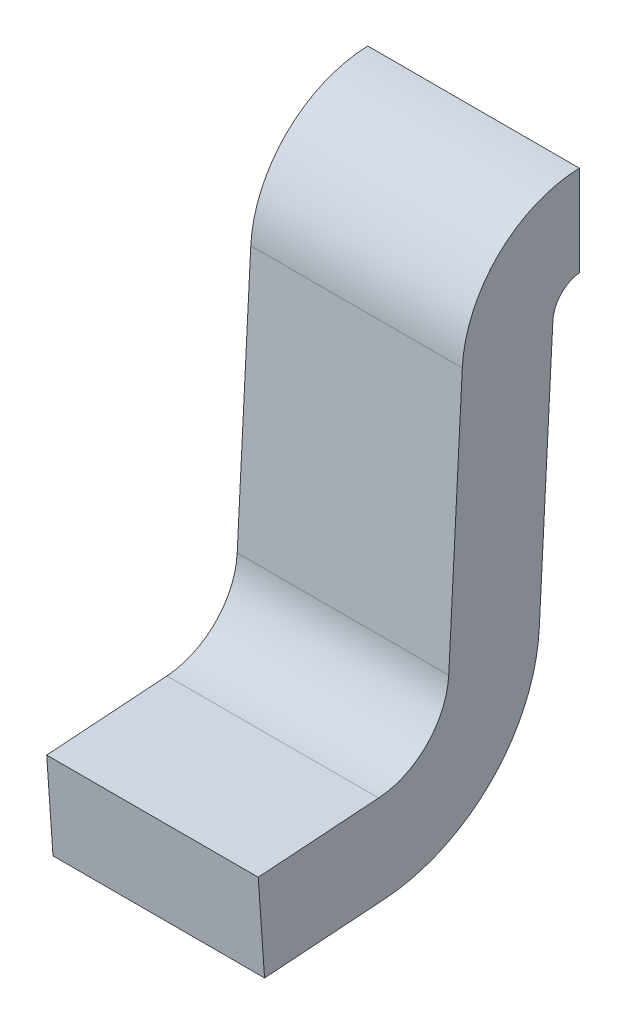
ISO-10303-21;
HEADER;
FILE_DESCRIPTION(('STEP AP214'),'2;1');
FILE_NAME('part.step','',(''),(''),'','','');
FILE_SCHEMA(('AUTOMOTIVE_DESIGN { 1 0 10303 214 1 1 1 1 }'));
ENDSEC;
DATA;
#1=APPLICATION_CONTEXT('core data for automotive mechanical design processes');
#2=APPLICATION_PROTOCOL_DEFINITION('international standard','automotive_design',2000,#1);
#3=PRODUCT_CONTEXT('',#1,'mechanical');
#4=PRODUCT('Part','Part','',(#3));
#5=PRODUCT_RELATED_PRODUCT_CATEGORY('part','',(#4));
#6=PRODUCT_DEFINITION_FORMATION('','',#4);
#7=PRODUCT_DEFINITION_CONTEXT('part definition',#1,'design');
#8=PRODUCT_DEFINITION('design','',#6,#7);
#9=PRODUCT_DEFINITION_SHAPE('','',#8);
#10=(LENGTH_UNIT() NAMED_UNIT(*) SI_UNIT(.MILLI.,.METRE.));
#11=(NAMED_UNIT(*) PLANE_ANGLE_UNIT() SI_UNIT($,.RADIAN.));
#12=(NAMED_UNIT(*) SI_UNIT($,.STERADIAN.) SOLID_ANGLE_UNIT());
#13=UNCERTAINTY_MEASURE_WITH_UNIT(LENGTH_MEASURE(1.E-05),#10,'distance_accuracy_value','');
#14=(GEOMETRIC_REPRESENTATION_CONTEXT(3) GLOBAL_UNCERTAINTY_ASSIGNED_CONTEXT((#13)) GLOBAL_UNIT_ASSIGNED_CONTEXT((#10,
#11,#12)) REPRESENTATION_CONTEXT('',''));
#15=CARTESIAN_POINT('',(0.,0.,0.));
#16=DIRECTION('',(0.,0.,1.));
#17=DIRECTION('',(1.,0.,0.));
#18=AXIS2_PLACEMENT_3D('',#15,#16,#17);
#19=CARTESIAN_POINT('',(0.14,0.,0.));
#20=DIRECTION('',(1.,0.,0.));
#21=DIRECTION('',(0.,1.,0.));
#22=AXIS2_PLACEMENT_3D('',#19,#20,#21);
#23=PLANE('',#22);
#24=CARTESIAN_POINT('',(0.14,0.08060123929937,0.21607778416));
#25=DIRECTION('',(1.,0.,0.));
#26=DIRECTION('',(0.,-0.997564050259825,-0.0697564737441177));
#27=AXIS2_PLACEMENT_3D('',#24,#25,#26);
#28=CIRCLE('',#27,0.1);
#29=CARTESIAN_POINT('',(0.14,-0.01915516572662,0.209102136786));
#30=VERTEX_POINT('',#29);
#31=CARTESIAN_POINT('',(0.14,0.07536764367507,0.116214830685));
#32=VERTEX_POINT('',#31);
#33=EDGE_CURVE('E11',#30,#32,#28,.T.);
#34=ORIENTED_EDGE('',*,*,#33,.F.);
#35=DIRECTION('',(0.,-0.0697564737441177,0.997564050259825));
#36=VECTOR('',#35,1.);
#37=CARTESIAN_POINT('',(0.14,-0.01915516572662,0.209102136786));
#38=LINE('',#37,#36);
#39=CARTESIAN_POINT('',(0.14,-0.03029231396882,0.368370776849));
#40=VERTEX_POINT('',#39);
#41=EDGE_CURVE('E42',#30,#40,#38,.T.);
#42=ORIENTED_EDGE('',*,*,#41,.T.);
#43=DIRECTION('',(0.,-0.997564050259825,-0.0697564737441177));
#44=VECTOR('',#43,1.);
#45=CARTESIAN_POINT('',(0.14,-0.03029231396882,0.368370776849));
#46=LINE('',#45,#44);
#47=CARTESIAN_POINT('',(0.14,-0.15,0.36));
#48=VERTEX_POINT('',#47);
#49=EDGE_CURVE('E203',#40,#48,#46,.T.);
#50=ORIENTED_EDGE('',*,*,#49,.T.);
#51=DIRECTION('',(0.,0.0697564737441177,-0.997564050259825));
#52=VECTOR('',#51,1.);
#53=CARTESIAN_POINT('',(0.14,-0.15,0.36));
#54=LINE('',#53,#52);
#55=CARTESIAN_POINT('',(0.14,-0.138862851758,0.200731359937));
#56=VERTEX_POINT('',#55);
#57=EDGE_CURVE('E129',#48,#56,#54,.T.);
#58=ORIENTED_EDGE('',*,*,#57,.T.);
#59=CARTESIAN_POINT('',(0.14,0.08060123929937,0.21607778416));
#60=DIRECTION('',(-1.,0.,0.));
#61=DIRECTION('',(0.,-0.0523359562429177,-0.998629534754575));
#62=AXIS2_PLACEMENT_3D('',#59,#60,#61);
#63=CIRCLE('',#62,0.22);
#64=CARTESIAN_POINT('',(0.14,0.06908732892592,-0.003620713485604));
#65=VERTEX_POINT('',#64);
#66=EDGE_CURVE('E125',#65,#56,#63,.T.);
#67=ORIENTED_EDGE('',*,*,#66,.F.);
#68=DIRECTION('',(0.,0.998629534754575,-0.0523359562429177));
#69=VECTOR('',#68,1.);
#70=CARTESIAN_POINT('',(0.14,0.06908732892592,-0.003620713485604));
#71=LINE('',#70,#69);
#72=CARTESIAN_POINT('',(0.14,0.412398267518,-0.02161287738079));
#73=VERTEX_POINT('',#72);
#74=EDGE_CURVE('E191',#65,#73,#71,.T.);
#75=ORIENTED_EDGE('',*,*,#74,.T.);
#76=CARTESIAN_POINT('',(0.14,0.410304829268,-0.06155805877097));
#77=DIRECTION('',(-1.,0.,0.));
#78=DIRECTION('',(0.,0.0523359562429277,0.998629534754575));
#79=AXIS2_PLACEMENT_3D('',#76,#77,#78);
#80=CIRCLE('',#79,0.04);
#81=CARTESIAN_POINT('',(0.14,0.45,-0.0566292231507));
#82=VERTEX_POINT('',#81);
#83=EDGE_CURVE('E187',#73,#82,#80,.T.);
#84=ORIENTED_EDGE('',*,*,#83,.T.);
#85=DIRECTION('',(0.,1.,0.));
#86=VECTOR('',#85,1.);
#87=CARTESIAN_POINT('',(0.14,0.45,-0.0566292231507));
#88=LINE('',#87,#86);
#89=CARTESIAN_POINT('',(0.14,0.57,-0.0566292231507));
#90=VERTEX_POINT('',#89);
#91=EDGE_CURVE('E177',#82,#90,#88,.T.);
#92=ORIENTED_EDGE('',*,*,#91,.T.);
#93=CARTESIAN_POINT('',(0.14,0.410075565103,-0.06154604354519));
#94=DIRECTION('',(1.,0.,0.));
#95=DIRECTION('',(0.,0.999527718107884,0.0307301274655264));
#96=AXIS2_PLACEMENT_3D('',#93,#94,#95);
#97=CIRCLE('',#96,0.16);
#98=CARTESIAN_POINT('',(0.14,0.418449318102,0.09823468201554));
#99=VERTEX_POINT('',#98);
#100=EDGE_CURVE('E157',#90,#99,#97,.T.);
#101=ORIENTED_EDGE('',*,*,#100,.T.);
#102=DIRECTION('',(0.,-0.998629534754575,0.0523359562429177));
#103=VECTOR('',#102,1.);
#104=CARTESIAN_POINT('',(0.14,0.418449318102,0.09823468201554));
#105=LINE('',#104,#103);
#106=EDGE_CURVE('E168',#99,#32,#105,.T.);
#107=ORIENTED_EDGE('',*,*,#106,.T.);
#108=EDGE_LOOP('',(#34,#42,#50,#58,#67,#75,#84,#92,#101,#107));
#109=FACE_BOUND('',#108,.T.);
#110=ADVANCED_FACE('F17',(#109),#23,.T.);
#111=CARTESIAN_POINT('',(-0.14,0.08060123929937,0.21607778416));
#112=DIRECTION('',(1.,0.,0.));
#113=DIRECTION('',(0.,-0.997564050259825,-0.0697564737441177));
#114=AXIS2_PLACEMENT_3D('',#111,#112,#113);
#115=CYLINDRICAL_SURFACE('',#114,0.1);
#116=ORIENTED_EDGE('',*,*,#33,.T.);
#117=DIRECTION('',(1.,0.,0.));
#118=VECTOR('',#117,1.);
#119=CARTESIAN_POINT('',(-0.14,0.07536764367507,0.116214830685));
#120=LINE('',#119,#118);
#121=CARTESIAN_POINT('',(-0.14,0.07536764367507,0.116214830685));
#122=VERTEX_POINT('',#121);
#123=EDGE_CURVE('E167',#122,#32,#120,.T.);
#124=ORIENTED_EDGE('',*,*,#123,.F.);
#125=CARTESIAN_POINT('',(-0.14,0.08060123929937,0.21607778416));
#126=DIRECTION('',(1.,0.,0.));
#127=DIRECTION('',(0.,-0.997564050259825,-0.0697564737441177));
#128=AXIS2_PLACEMENT_3D('',#125,#126,#127);
#129=CIRCLE('',#128,0.1);
#130=CARTESIAN_POINT('',(-0.14,-0.01915516572662,0.209102136786));
#131=VERTEX_POINT('',#130);
#132=EDGE_CURVE('E158',#131,#122,#129,.T.);
#133=ORIENTED_EDGE('',*,*,#132,.F.);
#134=DIRECTION('',(1.,0.,0.));
#135=VECTOR('',#134,1.);
#136=CARTESIAN_POINT('',(-0.14,-0.01915516572662,0.209102136786));
#137=LINE('',#136,#135);
#138=EDGE_CURVE('E25',#131,#30,#137,.T.);
#139=ORIENTED_EDGE('',*,*,#138,.T.);
#140=EDGE_LOOP('',(#116,#124,#133,#139));
#141=FACE_BOUND('',#140,.T.);
#142=ADVANCED_FACE('F215',(#141),#115,.F.);
#143=CARTESIAN_POINT('',(-0.14,-0.01298363425784,0.120845124958));
#144=DIRECTION('',(0.,0.997564050259825,0.0697564737441177));
#145=DIRECTION('',(1.,0.,0.));
#146=AXIS2_PLACEMENT_3D('',#143,#144,#145);
#147=PLANE('',#146);
#148=DIRECTION('',(1.,0.,0.));
#149=VECTOR('',#148,1.);
#150=CARTESIAN_POINT('',(-0.14,-0.03029231396882,0.368370776849));
#151=LINE('',#150,#149);
#152=CARTESIAN_POINT('',(-0.14,-0.03029231396882,0.368370776849));
#153=VERTEX_POINT('',#152);
#154=EDGE_CURVE('E206',#153,#40,#151,.T.);
#155=ORIENTED_EDGE('',*,*,#154,.T.);
#156=ORIENTED_EDGE('',*,*,#41,.F.);
#157=ORIENTED_EDGE('',*,*,#138,.F.);
#158=DIRECTION('',(0.,-0.0697564737441177,0.997564050259825));
#159=VECTOR('',#158,1.);
#160=CARTESIAN_POINT('',(-0.14,-0.01915516572662,0.209102136786));
#161=LINE('',#160,#159);
#162=EDGE_CURVE('E163',#131,#153,#161,.T.);
#163=ORIENTED_EDGE('',*,*,#162,.T.);
#164=EDGE_LOOP('',(#155,#156,#157,#163));
#165=FACE_BOUND('',#164,.T.);
#166=ADVANCED_FACE('F219',(#165),#147,.T.);
#167=CARTESIAN_POINT('',(-0.14,-0.03029231396882,0.368370776849));
#168=DIRECTION('',(0.,-0.0697564737441177,0.997564050259825));
#169=DIRECTION('',(-1.,0.,0.));
#170=AXIS2_PLACEMENT_3D('',#167,#168,#169);
#171=PLANE('',#170);
#172=DIRECTION('',(1.,0.,0.));
#173=VECTOR('',#172,1.);
#174=CARTESIAN_POINT('',(-0.14,-0.15,0.36));
#175=LINE('',#174,#173);
#176=CARTESIAN_POINT('',(-0.14,-0.15,0.36));
#177=VERTEX_POINT('',#176);
#178=EDGE_CURVE('E135',#177,#48,#175,.T.);
#179=ORIENTED_EDGE('',*,*,#178,.T.);
#180=ORIENTED_EDGE('',*,*,#49,.F.);
#181=ORIENTED_EDGE('',*,*,#154,.F.);
#182=DIRECTION('',(0.,-0.997564050259825,-0.0697564737441177));
#183=VECTOR('',#182,1.);
#184=CARTESIAN_POINT('',(-0.14,-0.03029231396882,0.368370776849));
#185=LINE('',#184,#183);
#186=EDGE_CURVE('E140',#153,#177,#185,.T.);
#187=ORIENTED_EDGE('',*,*,#186,.T.);
#188=EDGE_LOOP('',(#179,#180,#181,#187));
#189=FACE_BOUND('',#188,.T.);
#190=ADVANCED_FACE('F222',(#189),#171,.T.);
#191=CARTESIAN_POINT('',(-0.14,-0.15,0.36));
#192=DIRECTION('',(0.,-0.997564050259825,-0.0697564737441177));
#193=DIRECTION('',(0.,0.0697564737441177,-0.997564050259825));
#194=AXIS2_PLACEMENT_3D('',#191,#192,#193);
#195=PLANE('',#194);
#196=DIRECTION('',(1.,0.,0.));
#197=VECTOR('',#196,1.);
#198=CARTESIAN_POINT('',(-0.14,-0.138862851758,0.200731359937));
#199=LINE('',#198,#197);
#200=CARTESIAN_POINT('',(-0.14,-0.138862851758,0.200731359937));
#201=VERTEX_POINT('',#200);
#202=EDGE_CURVE('E118',#201,#56,#199,.T.);
#203=ORIENTED_EDGE('',*,*,#202,.T.);
#204=ORIENTED_EDGE('',*,*,#57,.F.);
#205=ORIENTED_EDGE('',*,*,#178,.F.);
#206=DIRECTION('',(0.,0.0697564737441177,-0.997564050259825));
#207=VECTOR('',#206,1.);
#208=CARTESIAN_POINT('',(-0.14,-0.15,0.36));
#209=LINE('',#208,#207);
#210=EDGE_CURVE('E132',#177,#201,#209,.T.);
#211=ORIENTED_EDGE('',*,*,#210,.T.);
#212=EDGE_LOOP('',(#203,#204,#205,#211));
#213=FACE_BOUND('',#212,.T.);
#214=ADVANCED_FACE('F133',(#213),#195,.T.);
#215=CARTESIAN_POINT('',(-0.14,0.08060123929937,0.21607778416));
#216=DIRECTION('',(-1.,0.,0.));
#217=DIRECTION('',(0.,-0.0523359562429177,-0.998629534754575));
#218=AXIS2_PLACEMENT_3D('',#215,#216,#217);
#219=CYLINDRICAL_SURFACE('',#218,0.22);
#220=ORIENTED_EDGE('',*,*,#66,.T.);
#221=ORIENTED_EDGE('',*,*,#202,.F.);
#222=CARTESIAN_POINT('',(-0.14,0.08060123929937,0.21607778416));
#223=DIRECTION('',(-1.,0.,0.));
#224=DIRECTION('',(0.,-0.0523359562429177,-0.998629534754575));
#225=AXIS2_PLACEMENT_3D('',#222,#223,#224);
#226=CIRCLE('',#225,0.22);
#227=CARTESIAN_POINT('',(-0.14,0.06908732892592,-0.003620713485604));
#228=VERTEX_POINT('',#227);
#229=EDGE_CURVE('E123',#228,#201,#226,.T.);
#230=ORIENTED_EDGE('',*,*,#229,.F.);
#231=DIRECTION('',(1.,0.,0.));
#232=VECTOR('',#231,1.);
#233=CARTESIAN_POINT('',(-0.14,0.06908732892592,-0.003620713485604));
#234=LINE('',#233,#232);
#235=EDGE_CURVE('E194',#228,#65,#234,.T.);
#236=ORIENTED_EDGE('',*,*,#235,.T.);
#237=EDGE_LOOP('',(#220,#221,#230,#236));
#238=FACE_BOUND('',#237,.T.);
#239=ADVANCED_FACE('F120',(#238),#219,.T.);
#240=CARTESIAN_POINT('',(-0.14,-0.125285482527,0.006565933915618));
#241=DIRECTION('',(0.,-0.0523359562429177,-0.998629534754575));
#242=DIRECTION('',(0.,-0.998629534754575,0.0523359562429177));
#243=AXIS2_PLACEMENT_3D('',#240,#241,#242);
#244=PLANE('',#243);
#245=DIRECTION('',(1.,0.,0.));
#246=VECTOR('',#245,1.);
#247=CARTESIAN_POINT('',(-0.14,0.412398267518,-0.02161287738079));
#248=LINE('',#247,#246);
#249=CARTESIAN_POINT('',(-0.14,0.412398267518,-0.02161287738079));
#250=VERTEX_POINT('',#249);
#251=EDGE_CURVE('E190',#250,#73,#248,.T.);
#252=ORIENTED_EDGE('',*,*,#251,.T.);
#253=ORIENTED_EDGE('',*,*,#74,.F.);
#254=ORIENTED_EDGE('',*,*,#235,.F.);
#255=DIRECTION('',(0.,-0.998629534754575,0.0523359562429177));
#256=VECTOR('',#255,1.);
#257=CARTESIAN_POINT('',(-0.14,0.412398267518,-0.02161287738079));
#258=LINE('',#257,#256);
#259=EDGE_CURVE('E146',#250,#228,#258,.T.);
#260=ORIENTED_EDGE('',*,*,#259,.F.);
#261=EDGE_LOOP('',(#252,#253,#254,#260));
#262=FACE_BOUND('',#261,.T.);
#263=ADVANCED_FACE('F226',(#262),#244,.T.);
#264=CARTESIAN_POINT('',(-0.508824635799,0.410304829268,-0.06155805877097));
#265=DIRECTION('',(1.,0.,0.));
#266=DIRECTION('',(0.,0.992379268295483,0.123220890506936));
#267=AXIS2_PLACEMENT_3D('',#264,#265,#266);
#268=CYLINDRICAL_SURFACE('',#267,0.04);
#269=ORIENTED_EDGE('',*,*,#83,.F.);
#270=ORIENTED_EDGE('',*,*,#251,.F.);
#271=CARTESIAN_POINT('',(-0.14,0.410304829268,-0.06155805877097));
#272=DIRECTION('',(1.,0.,0.));
#273=DIRECTION('',(0.,0.992379268295483,0.123220890506936));
#274=AXIS2_PLACEMENT_3D('',#271,#272,#273);
#275=CIRCLE('',#274,0.04);
#276=CARTESIAN_POINT('',(-0.14,0.45,-0.0566292231507));
#277=VERTEX_POINT('',#276);
#278=EDGE_CURVE('E153',#277,#250,#275,.T.);
#279=ORIENTED_EDGE('',*,*,#278,.F.);
#280=DIRECTION('',(1.,0.,0.));
#281=VECTOR('',#280,1.);
#282=CARTESIAN_POINT('',(-0.14,0.45,-0.0566292231507));
#283=LINE('',#282,#281);
#284=EDGE_CURVE('E180',#277,#82,#283,.T.);
#285=ORIENTED_EDGE('',*,*,#284,.T.);
#286=EDGE_LOOP('',(#269,#270,#279,#285));
#287=FACE_BOUND('',#286,.T.);
#288=ADVANCED_FACE('F232',(#287),#268,.F.);
#289=CARTESIAN_POINT('',(-0.14,0.45,-0.0566292231507));
#290=DIRECTION('',(0.,0.,-1.));
#291=DIRECTION('',(0.,-1.,0.));
#292=AXIS2_PLACEMENT_3D('',#289,#290,#291);
#293=PLANE('',#292);
#294=ORIENTED_EDGE('',*,*,#91,.F.);
#295=ORIENTED_EDGE('',*,*,#284,.F.);
#296=DIRECTION('',(0.,1.,0.));
#297=VECTOR('',#296,1.);
#298=CARTESIAN_POINT('',(-0.14,0.45,-0.0566292231507));
#299=LINE('',#298,#297);
#300=CARTESIAN_POINT('',(-0.14,0.57,-0.0566292231507));
#301=VERTEX_POINT('',#300);
#302=EDGE_CURVE('E241',#277,#301,#299,.T.);
#303=ORIENTED_EDGE('',*,*,#302,.T.);
#304=DIRECTION('',(-1.,0.,0.));
#305=VECTOR('',#304,1.);
#306=CARTESIAN_POINT('',(0.14,0.57,-0.0566292231507));
#307=LINE('',#306,#305);
#308=EDGE_CURVE('E181',#90,#301,#307,.T.);
#309=ORIENTED_EDGE('',*,*,#308,.F.);
#310=EDGE_LOOP('',(#294,#295,#303,#309));
#311=FACE_BOUND('',#310,.T.);
#312=ADVANCED_FACE('F239',(#311),#293,.T.);
#313=CARTESIAN_POINT('',(0.508824635799,0.410075565103,-0.06154604354519));
#314=DIRECTION('',(-1.,0.,0.));
#315=DIRECTION('',(0.,0.0523359562429177,0.998629534754575));
#316=AXIS2_PLACEMENT_3D('',#313,#314,#315);
#317=CYLINDRICAL_SURFACE('',#316,0.16);
#318=DIRECTION('',(-1.,0.,0.));
#319=VECTOR('',#318,1.);
#320=CARTESIAN_POINT('',(0.14,0.418449318102,0.09823468201554));
#321=LINE('',#320,#319);
#322=CARTESIAN_POINT('',(-0.14,0.418449318102,0.09823468201554));
#323=VERTEX_POINT('',#322);
#324=EDGE_CURVE('E171',#99,#323,#321,.T.);
#325=ORIENTED_EDGE('',*,*,#324,.F.);
#326=ORIENTED_EDGE('',*,*,#100,.F.);
#327=ORIENTED_EDGE('',*,*,#308,.T.);
#328=CARTESIAN_POINT('',(-0.14,0.410075565103,-0.06154604354519));
#329=DIRECTION('',(-1.,0.,0.));
#330=DIRECTION('',(0.,0.0523359562429177,0.998629534754575));
#331=AXIS2_PLACEMENT_3D('',#328,#329,#330);
#332=CIRCLE('',#331,0.16);
#333=EDGE_CURVE('E296',#323,#301,#332,.T.);
#334=ORIENTED_EDGE('',*,*,#333,.F.);
#335=EDGE_LOOP('',(#325,#326,#327,#334));
#336=FACE_BOUND('',#335,.T.);
#337=ADVANCED_FACE('F244',(#336),#317,.T.);
#338=CARTESIAN_POINT('',(-0.14,0.006280314749153,0.119835544171));
#339=DIRECTION('',(0.,0.0523359562429177,0.998629534754575));
#340=DIRECTION('',(1.,0.,0.));
#341=AXIS2_PLACEMENT_3D('',#338,#339,#340);
#342=PLANE('',#341);
#343=ORIENTED_EDGE('',*,*,#123,.T.);
#344=ORIENTED_EDGE('',*,*,#106,.F.);
#345=ORIENTED_EDGE('',*,*,#324,.T.);
#346=DIRECTION('',(0.,0.998629534754575,-0.0523359562429177));
#347=VECTOR('',#346,1.);
#348=CARTESIAN_POINT('',(-0.14,0.07536764367507,0.116214830685));
#349=LINE('',#348,#347);
#350=EDGE_CURVE('E162',#122,#323,#349,.T.);
#351=ORIENTED_EDGE('',*,*,#350,.F.);
#352=EDGE_LOOP('',(#343,#344,#345,#351));
#353=FACE_BOUND('',#352,.T.);
#354=ADVANCED_FACE('F360',(#353),#342,.T.);
#355=CARTESIAN_POINT('',(-0.14,0.,0.));
#356=DIRECTION('',(1.,0.,0.));
#357=DIRECTION('',(0.,1.,0.));
#358=AXIS2_PLACEMENT_3D('',#355,#356,#357);
#359=PLANE('',#358);
#360=ORIENTED_EDGE('',*,*,#333,.T.);
#361=ORIENTED_EDGE('',*,*,#302,.F.);
#362=ORIENTED_EDGE('',*,*,#278,.T.);
#363=ORIENTED_EDGE('',*,*,#259,.T.);
#364=ORIENTED_EDGE('',*,*,#229,.T.);
#365=ORIENTED_EDGE('',*,*,#210,.F.);
#366=ORIENTED_EDGE('',*,*,#186,.F.);
#367=ORIENTED_EDGE('',*,*,#162,.F.);
#368=ORIENTED_EDGE('',*,*,#132,.T.);
#369=ORIENTED_EDGE('',*,*,#350,.T.);
#370=EDGE_LOOP('',(#360,#361,#362,#363,#364,#365,#366,#367,#368,#369));
#371=FACE_BOUND('',#370,.T.);
#372=ADVANCED_FACE('F143',(#371),#359,.F.);
#373=CLOSED_SHELL('',(#110,#142,#166,#190,#214,#239,#263,#288,#312,#337,#354,#372));
#374=MANIFOLD_SOLID_BREP('B1',#373);
#375=ADVANCED_BREP_SHAPE_REPRESENTATION('',(#18,#374),#14);
#376=SHAPE_DEFINITION_REPRESENTATION(#9,#375);
ENDSEC;
END-ISO-10303-21;
